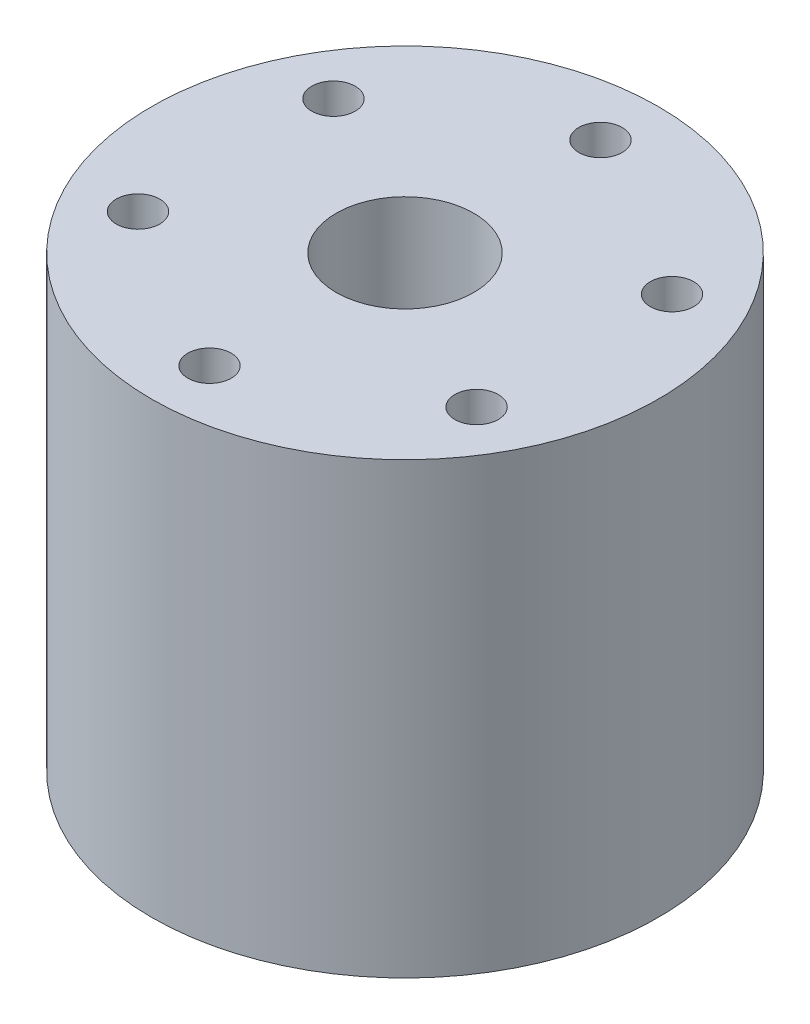
ISO-10303-21;
HEADER;
FILE_DESCRIPTION(('STEP AP214'),'2;1');
FILE_NAME('part.step','',(''),(''),'','','');
FILE_SCHEMA(('AUTOMOTIVE_DESIGN { 1 0 10303 214 1 1 1 1 }'));
ENDSEC;
DATA;
#1=APPLICATION_CONTEXT('core data for automotive mechanical design processes');
#2=APPLICATION_PROTOCOL_DEFINITION('international standard','automotive_design',2000,#1);
#3=PRODUCT_CONTEXT('',#1,'mechanical');
#4=PRODUCT('Part','Part','',(#3));
#5=PRODUCT_RELATED_PRODUCT_CATEGORY('part','',(#4));
#6=PRODUCT_DEFINITION_FORMATION('','',#4);
#7=PRODUCT_DEFINITION_CONTEXT('part definition',#1,'design');
#8=PRODUCT_DEFINITION('design','',#6,#7);
#9=PRODUCT_DEFINITION_SHAPE('','',#8);
#10=(LENGTH_UNIT() NAMED_UNIT(*) SI_UNIT(.MILLI.,.METRE.));
#11=(NAMED_UNIT(*) PLANE_ANGLE_UNIT() SI_UNIT($,.RADIAN.));
#12=(NAMED_UNIT(*) SI_UNIT($,.STERADIAN.) SOLID_ANGLE_UNIT());
#13=UNCERTAINTY_MEASURE_WITH_UNIT(LENGTH_MEASURE(1.E-05),#10,'distance_accuracy_value','');
#14=(GEOMETRIC_REPRESENTATION_CONTEXT(3) GLOBAL_UNCERTAINTY_ASSIGNED_CONTEXT((#13)) GLOBAL_UNIT_ASSIGNED_CONTEXT((#10,
#11,#12)) REPRESENTATION_CONTEXT('',''));
#15=CARTESIAN_POINT('',(0.,0.,0.));
#16=DIRECTION('',(0.,0.,1.));
#17=DIRECTION('',(1.,0.,0.));
#18=AXIS2_PLACEMENT_3D('',#15,#16,#17);
#19=CARTESIAN_POINT('',(11.6913429510899,31.,-6.74999999999997));
#20=DIRECTION('',(0.,-1.,0.));
#21=DIRECTION('',(0.,0.,-1.));
#22=AXIS2_PLACEMENT_3D('',#19,#20,#21);
#23=CYLINDRICAL_SURFACE('',#22,1.5);
#24=CARTESIAN_POINT('',(11.6913429510899,31.,-6.74999999999997));
#25=DIRECTION('',(0.,1.,0.));
#26=DIRECTION('',(0.,0.,1.));
#27=AXIS2_PLACEMENT_3D('',#24,#25,#26);
#28=CIRCLE('',#27,1.5);
#29=CARTESIAN_POINT('',(11.6913429510899,31.,-5.24999999999997));
#30=VERTEX_POINT('',#29);
#31=EDGE_CURVE('E43',#30,#30,#28,.T.);
#32=ORIENTED_EDGE('',*,*,#31,.T.);
#33=EDGE_LOOP('',(#32));
#34=FACE_BOUND('',#33,.T.);
#35=CARTESIAN_POINT('',(11.6913429510899,0.,-6.74999999999997));
#36=DIRECTION('',(0.,1.,0.));
#37=DIRECTION('',(0.,0.,1.));
#38=AXIS2_PLACEMENT_3D('',#35,#36,#37);
#39=CIRCLE('',#38,1.5);
#40=CARTESIAN_POINT('',(11.6913429510899,0.,-5.24999999999997));
#41=VERTEX_POINT('',#40);
#42=EDGE_CURVE('E69',#41,#41,#39,.T.);
#43=ORIENTED_EDGE('',*,*,#42,.F.);
#44=EDGE_LOOP('',(#43));
#45=FACE_BOUND('',#44,.T.);
#46=ADVANCED_FACE('F35',(#34,#45),#23,.F.);
#47=CARTESIAN_POINT('',(0.,31.,0.));
#48=DIRECTION('',(0.,-1.,0.));
#49=DIRECTION('',(0.,0.,-1.));
#50=AXIS2_PLACEMENT_3D('',#47,#48,#49);
#51=CYLINDRICAL_SURFACE('',#50,4.75);
#52=CARTESIAN_POINT('',(0.,31.,0.));
#53=DIRECTION('',(0.,1.,0.));
#54=DIRECTION('',(0.,0.,1.));
#55=AXIS2_PLACEMENT_3D('',#52,#53,#54);
#56=CIRCLE('',#55,4.75);
#57=CARTESIAN_POINT('',(0.,31.,4.75));
#58=VERTEX_POINT('',#57);
#59=EDGE_CURVE('E48',#58,#58,#56,.T.);
#60=ORIENTED_EDGE('',*,*,#59,.T.);
#61=EDGE_LOOP('',(#60));
#62=FACE_BOUND('',#61,.T.);
#63=CARTESIAN_POINT('',(0.,0.,0.));
#64=DIRECTION('',(0.,1.,0.));
#65=DIRECTION('',(0.,0.,1.));
#66=AXIS2_PLACEMENT_3D('',#63,#64,#65);
#67=CIRCLE('',#66,4.75);
#68=CARTESIAN_POINT('',(0.,0.,4.75));
#69=VERTEX_POINT('',#68);
#70=EDGE_CURVE('E67',#69,#69,#67,.T.);
#71=ORIENTED_EDGE('',*,*,#70,.F.);
#72=EDGE_LOOP('',(#71));
#73=FACE_BOUND('',#72,.T.);
#74=ADVANCED_FACE('F96',(#62,#73),#51,.F.);
#75=CARTESIAN_POINT('',(0.,31.,-13.5));
#76=DIRECTION('',(0.,-1.,0.));
#77=DIRECTION('',(0.,0.,-1.));
#78=AXIS2_PLACEMENT_3D('',#75,#76,#77);
#79=CYLINDRICAL_SURFACE('',#78,1.5);
#80=CARTESIAN_POINT('',(0.,31.,-13.5));
#81=DIRECTION('',(0.,1.,0.));
#82=DIRECTION('',(0.,0.,1.));
#83=AXIS2_PLACEMENT_3D('',#80,#81,#82);
#84=CIRCLE('',#83,1.5);
#85=CARTESIAN_POINT('',(0.,31.,-12.));
#86=VERTEX_POINT('',#85);
#87=EDGE_CURVE('E91',#86,#86,#84,.T.);
#88=ORIENTED_EDGE('',*,*,#87,.T.);
#89=EDGE_LOOP('',(#88));
#90=FACE_BOUND('',#89,.T.);
#91=CARTESIAN_POINT('',(0.,0.,-13.5));
#92=DIRECTION('',(0.,1.,0.));
#93=DIRECTION('',(0.,0.,1.));
#94=AXIS2_PLACEMENT_3D('',#91,#92,#93);
#95=CIRCLE('',#94,1.5);
#96=CARTESIAN_POINT('',(0.,0.,-12.));
#97=VERTEX_POINT('',#96);
#98=EDGE_CURVE('E64',#97,#97,#95,.T.);
#99=ORIENTED_EDGE('',*,*,#98,.F.);
#100=EDGE_LOOP('',(#99));
#101=FACE_BOUND('',#100,.T.);
#102=ADVANCED_FACE('F114',(#90,#101),#79,.F.);
#103=CARTESIAN_POINT('',(11.6913429510908,31.,6.7499999999995));
#104=DIRECTION('',(0.,-1.,0.));
#105=DIRECTION('',(0.,0.,-1.));
#106=AXIS2_PLACEMENT_3D('',#103,#104,#105);
#107=CYLINDRICAL_SURFACE('',#106,1.50000000000074);
#108=CARTESIAN_POINT('',(11.6913429510908,31.,6.7499999999995));
#109=DIRECTION('',(0.,1.,0.));
#110=DIRECTION('',(0.,0.,1.));
#111=AXIS2_PLACEMENT_3D('',#108,#109,#110);
#112=CIRCLE('',#111,1.50000000000074);
#113=CARTESIAN_POINT('',(11.6913429510908,31.,8.25000000000025));
#114=VERTEX_POINT('',#113);
#115=EDGE_CURVE('E88',#114,#114,#112,.T.);
#116=ORIENTED_EDGE('',*,*,#115,.T.);
#117=EDGE_LOOP('',(#116));
#118=FACE_BOUND('',#117,.T.);
#119=CARTESIAN_POINT('',(11.6913429510908,0.,6.7499999999995));
#120=DIRECTION('',(0.,1.,0.));
#121=DIRECTION('',(0.,0.,1.));
#122=AXIS2_PLACEMENT_3D('',#119,#120,#121);
#123=CIRCLE('',#122,1.50000000000074);
#124=CARTESIAN_POINT('',(11.6913429510908,0.,8.25000000000025));
#125=VERTEX_POINT('',#124);
#126=EDGE_CURVE('E61',#125,#125,#123,.T.);
#127=ORIENTED_EDGE('',*,*,#126,.F.);
#128=EDGE_LOOP('',(#127));
#129=FACE_BOUND('',#128,.T.);
#130=ADVANCED_FACE('F121',(#118,#129),#107,.F.);
#131=CARTESIAN_POINT('',(1.15029657501919E-12,31.,13.5));
#132=DIRECTION('',(0.,-1.,0.));
#133=DIRECTION('',(0.,0.,-1.));
#134=AXIS2_PLACEMENT_3D('',#131,#132,#133);
#135=CYLINDRICAL_SURFACE('',#134,1.50000000000119);
#136=CARTESIAN_POINT('',(1.15029657501919E-12,31.,13.5));
#137=DIRECTION('',(0.,1.,0.));
#138=DIRECTION('',(0.,0.,1.));
#139=AXIS2_PLACEMENT_3D('',#136,#137,#138);
#140=CIRCLE('',#139,1.50000000000119);
#141=CARTESIAN_POINT('',(1.15029657501919E-12,31.,15.0000000000012));
#142=VERTEX_POINT('',#141);
#143=EDGE_CURVE('E83',#142,#142,#140,.T.);
#144=ORIENTED_EDGE('',*,*,#143,.T.);
#145=EDGE_LOOP('',(#144));
#146=FACE_BOUND('',#145,.T.);
#147=CARTESIAN_POINT('',(1.15029657501919E-12,0.,13.5));
#148=DIRECTION('',(0.,1.,0.));
#149=DIRECTION('',(0.,0.,1.));
#150=AXIS2_PLACEMENT_3D('',#147,#148,#149);
#151=CIRCLE('',#150,1.50000000000119);
#152=CARTESIAN_POINT('',(1.15029657501919E-12,0.,15.0000000000012));
#153=VERTEX_POINT('',#152);
#154=EDGE_CURVE('E58',#153,#153,#151,.T.);
#155=ORIENTED_EDGE('',*,*,#154,.F.);
#156=EDGE_LOOP('',(#155));
#157=FACE_BOUND('',#156,.T.);
#158=ADVANCED_FACE('F125',(#146,#157),#135,.F.);
#159=CARTESIAN_POINT('',(-11.6913429510891,31.,6.7500000000005));
#160=DIRECTION('',(0.,-1.,0.));
#161=DIRECTION('',(0.,0.,-1.));
#162=AXIS2_PLACEMENT_3D('',#159,#160,#161);
#163=CYLINDRICAL_SURFACE('',#162,1.5000000000011);
#164=CARTESIAN_POINT('',(-11.6913429510891,31.,6.7500000000005));
#165=DIRECTION('',(0.,1.,0.));
#166=DIRECTION('',(0.,0.,1.));
#167=AXIS2_PLACEMENT_3D('',#164,#165,#166);
#168=CIRCLE('',#167,1.5000000000011);
#169=CARTESIAN_POINT('',(-11.6913429510891,31.,8.2500000000016));
#170=VERTEX_POINT('',#169);
#171=EDGE_CURVE('E78',#170,#170,#168,.T.);
#172=ORIENTED_EDGE('',*,*,#171,.T.);
#173=EDGE_LOOP('',(#172));
#174=FACE_BOUND('',#173,.T.);
#175=CARTESIAN_POINT('',(-11.6913429510891,0.,6.7500000000005));
#176=DIRECTION('',(0.,1.,0.));
#177=DIRECTION('',(0.,0.,1.));
#178=AXIS2_PLACEMENT_3D('',#175,#176,#177);
#179=CIRCLE('',#178,1.5000000000011);
#180=CARTESIAN_POINT('',(-11.6913429510891,0.,8.2500000000016));
#181=VERTEX_POINT('',#180);
#182=EDGE_CURVE('E55',#181,#181,#179,.T.);
#183=ORIENTED_EDGE('',*,*,#182,.F.);
#184=EDGE_LOOP('',(#183));
#185=FACE_BOUND('',#184,.T.);
#186=ADVANCED_FACE('F128',(#174,#185),#163,.F.);
#187=CARTESIAN_POINT('',(-11.6913429510898,31.,-6.75000000000014));
#188=DIRECTION('',(0.,-1.,0.));
#189=DIRECTION('',(0.,0.,-1.));
#190=AXIS2_PLACEMENT_3D('',#187,#188,#189);
#191=CYLINDRICAL_SURFACE('',#190,1.5);
#192=CARTESIAN_POINT('',(-11.6913429510898,31.,-6.75000000000014));
#193=DIRECTION('',(0.,1.,0.));
#194=DIRECTION('',(0.,0.,1.));
#195=AXIS2_PLACEMENT_3D('',#192,#193,#194);
#196=CIRCLE('',#195,1.5);
#197=CARTESIAN_POINT('',(-11.6913429510898,31.,-5.25000000000014));
#198=VERTEX_POINT('',#197);
#199=EDGE_CURVE('E74',#198,#198,#196,.T.);
#200=ORIENTED_EDGE('',*,*,#199,.T.);
#201=EDGE_LOOP('',(#200));
#202=FACE_BOUND('',#201,.T.);
#203=CARTESIAN_POINT('',(-11.6913429510898,0.,-6.75000000000014));
#204=DIRECTION('',(0.,1.,0.));
#205=DIRECTION('',(0.,0.,1.));
#206=AXIS2_PLACEMENT_3D('',#203,#204,#205);
#207=CIRCLE('',#206,1.5);
#208=CARTESIAN_POINT('',(-11.6913429510898,0.,-5.25000000000014));
#209=VERTEX_POINT('',#208);
#210=EDGE_CURVE('E52',#209,#209,#207,.T.);
#211=ORIENTED_EDGE('',*,*,#210,.F.);
#212=EDGE_LOOP('',(#211));
#213=FACE_BOUND('',#212,.T.);
#214=ADVANCED_FACE('F37',(#202,#213),#191,.F.);
#215=CARTESIAN_POINT('',(0.,31.,0.));
#216=DIRECTION('',(0.,-1.,0.));
#217=DIRECTION('',(0.,0.,-1.));
#218=AXIS2_PLACEMENT_3D('',#215,#216,#217);
#219=CYLINDRICAL_SURFACE('',#218,17.5);
#220=CARTESIAN_POINT('',(0.,31.,0.));
#221=DIRECTION('',(0.,1.,0.));
#222=DIRECTION('',(0.,0.,1.));
#223=AXIS2_PLACEMENT_3D('',#220,#221,#222);
#224=CIRCLE('',#223,17.5);
#225=CARTESIAN_POINT('',(0.,31.,17.5));
#226=VERTEX_POINT('',#225);
#227=EDGE_CURVE('E10',#226,#226,#224,.T.);
#228=ORIENTED_EDGE('',*,*,#227,.F.);
#229=EDGE_LOOP('',(#228));
#230=FACE_BOUND('',#229,.T.);
#231=CARTESIAN_POINT('',(0.,0.,0.));
#232=DIRECTION('',(0.,1.,0.));
#233=DIRECTION('',(0.,0.,1.));
#234=AXIS2_PLACEMENT_3D('',#231,#232,#233);
#235=CIRCLE('',#234,17.5);
#236=CARTESIAN_POINT('',(0.,0.,17.5));
#237=VERTEX_POINT('',#236);
#238=EDGE_CURVE('E39',#237,#237,#235,.T.);
#239=ORIENTED_EDGE('',*,*,#238,.T.);
#240=EDGE_LOOP('',(#239));
#241=FACE_BOUND('',#240,.T.);
#242=ADVANCED_FACE('F103',(#230,#241),#219,.T.);
#243=CARTESIAN_POINT('',(0.,31.,0.));
#244=DIRECTION('',(0.,1.,0.));
#245=DIRECTION('',(0.,0.,1.));
#246=AXIS2_PLACEMENT_3D('',#243,#244,#245);
#247=PLANE('',#246);
#248=ORIENTED_EDGE('',*,*,#199,.F.);
#249=EDGE_LOOP('',(#248));
#250=FACE_BOUND('',#249,.T.);
#251=ORIENTED_EDGE('',*,*,#171,.F.);
#252=EDGE_LOOP('',(#251));
#253=FACE_BOUND('',#252,.T.);
#254=ORIENTED_EDGE('',*,*,#143,.F.);
#255=EDGE_LOOP('',(#254));
#256=FACE_BOUND('',#255,.T.);
#257=ORIENTED_EDGE('',*,*,#115,.F.);
#258=EDGE_LOOP('',(#257));
#259=FACE_BOUND('',#258,.T.);
#260=ORIENTED_EDGE('',*,*,#87,.F.);
#261=EDGE_LOOP('',(#260));
#262=FACE_BOUND('',#261,.T.);
#263=ORIENTED_EDGE('',*,*,#59,.F.);
#264=EDGE_LOOP('',(#263));
#265=FACE_BOUND('',#264,.T.);
#266=ORIENTED_EDGE('',*,*,#31,.F.);
#267=EDGE_LOOP('',(#266));
#268=FACE_BOUND('',#267,.T.);
#269=ORIENTED_EDGE('',*,*,#227,.T.);
#270=EDGE_LOOP('',(#269));
#271=FACE_BOUND('',#270,.T.);
#272=ADVANCED_FACE('F99',(#250,#253,#256,#259,#262,#265,#268,#271),#247,.T.);
#273=CARTESIAN_POINT('',(0.,0.,0.));
#274=DIRECTION('',(0.,1.,0.));
#275=DIRECTION('',(0.,0.,1.));
#276=AXIS2_PLACEMENT_3D('',#273,#274,#275);
#277=PLANE('',#276);
#278=ORIENTED_EDGE('',*,*,#210,.T.);
#279=EDGE_LOOP('',(#278));
#280=FACE_BOUND('',#279,.T.);
#281=ORIENTED_EDGE('',*,*,#182,.T.);
#282=EDGE_LOOP('',(#281));
#283=FACE_BOUND('',#282,.T.);
#284=ORIENTED_EDGE('',*,*,#154,.T.);
#285=EDGE_LOOP('',(#284));
#286=FACE_BOUND('',#285,.T.);
#287=ORIENTED_EDGE('',*,*,#126,.T.);
#288=EDGE_LOOP('',(#287));
#289=FACE_BOUND('',#288,.T.);
#290=ORIENTED_EDGE('',*,*,#98,.T.);
#291=EDGE_LOOP('',(#290));
#292=FACE_BOUND('',#291,.T.);
#293=ORIENTED_EDGE('',*,*,#70,.T.);
#294=EDGE_LOOP('',(#293));
#295=FACE_BOUND('',#294,.T.);
#296=ORIENTED_EDGE('',*,*,#42,.T.);
#297=EDGE_LOOP('',(#296));
#298=FACE_BOUND('',#297,.T.);
#299=ORIENTED_EDGE('',*,*,#238,.F.);
#300=EDGE_LOOP('',(#299));
#301=FACE_BOUND('',#300,.T.);
#302=ADVANCED_FACE('F102',(#280,#283,#286,#289,#292,#295,#298,#301),#277,.F.);
#303=CLOSED_SHELL('',(#46,#74,#102,#130,#158,#186,#214,#242,#272,#302));
#304=MANIFOLD_SOLID_BREP('B2',#303);
#305=ADVANCED_BREP_SHAPE_REPRESENTATION('',(#18,#304),#14);
#306=SHAPE_DEFINITION_REPRESENTATION(#9,#305);
ENDSEC;
END-ISO-10303-21;
